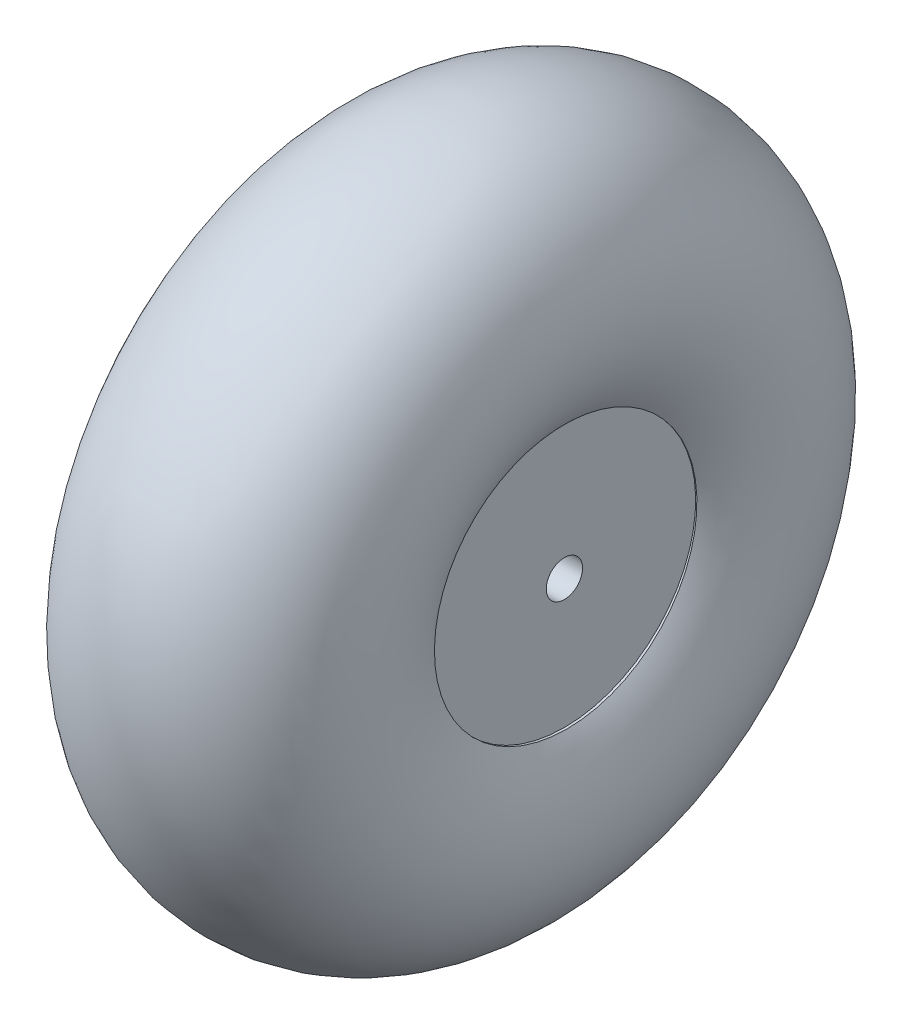
ISO-10303-21;
HEADER;
FILE_DESCRIPTION(('STEP AP214'),'2;1');
FILE_NAME('part.step','',(''),(''),'','','');
FILE_SCHEMA(('AUTOMOTIVE_DESIGN { 1 0 10303 214 1 1 1 1 }'));
ENDSEC;
DATA;
#1=APPLICATION_CONTEXT('core data for automotive mechanical design processes');
#2=APPLICATION_PROTOCOL_DEFINITION('international standard','automotive_design',2000,#1);
#3=PRODUCT_CONTEXT('',#1,'mechanical');
#4=PRODUCT('Part','Part','',(#3));
#5=PRODUCT_RELATED_PRODUCT_CATEGORY('part','',(#4));
#6=PRODUCT_DEFINITION_FORMATION('','',#4);
#7=PRODUCT_DEFINITION_CONTEXT('part definition',#1,'design');
#8=PRODUCT_DEFINITION('design','',#6,#7);
#9=PRODUCT_DEFINITION_SHAPE('','',#8);
#10=(LENGTH_UNIT() NAMED_UNIT(*) SI_UNIT(.MILLI.,.METRE.));
#11=(NAMED_UNIT(*) PLANE_ANGLE_UNIT() SI_UNIT($,.RADIAN.));
#12=(NAMED_UNIT(*) SI_UNIT($,.STERADIAN.) SOLID_ANGLE_UNIT());
#13=UNCERTAINTY_MEASURE_WITH_UNIT(LENGTH_MEASURE(1.E-05),#10,'distance_accuracy_value','');
#14=(GEOMETRIC_REPRESENTATION_CONTEXT(3) GLOBAL_UNCERTAINTY_ASSIGNED_CONTEXT((#13)) GLOBAL_UNIT_ASSIGNED_CONTEXT((#10,
#11,#12)) REPRESENTATION_CONTEXT('',''));
#15=CARTESIAN_POINT('',(0.,0.,0.));
#16=DIRECTION('',(0.,0.,1.));
#17=DIRECTION('',(1.,0.,0.));
#18=AXIS2_PLACEMENT_3D('',#15,#16,#17);
#19=CARTESIAN_POINT('',(6.46192450941706,0.0628953833462041,0.));
#20=DIRECTION('',(-0.999952635503498,-0.00973276680134316,0.));
#21=DIRECTION('',(0.00973276680134316,-0.999952635503498,0.));
#22=AXIS2_PLACEMENT_3D('',#19,#20,#21);
#23=TOROIDAL_SURFACE('',#22,11.4997627808792,7.62);
#24=CARTESIAN_POINT('',(0.0715324477310187,0.000696241609628558,0.));
#25=DIRECTION('',(-0.999952635503498,-0.00973276680134316,0.));
#26=DIRECTION('',(0.00973276680134316,-0.999952635503498,0.));
#27=AXIS2_PLACEMENT_3D('',#24,#25,#26);
#28=CIRCLE('',#27,7.34965187095071);
#29=CARTESIAN_POINT('',(0.143064895462037,-7.34860751678074,0.));
#30=VERTEX_POINT('',#29);
#31=EDGE_CURVE('E55',#30,#30,#28,.T.);
#32=ORIENTED_EDGE('',*,*,#31,.F.);
#33=EDGE_LOOP('',(#32));
#34=FACE_BOUND('',#33,.T.);
#35=CARTESIAN_POINT('',(12.770329418011,0.124296525444178,0.));
#36=DIRECTION('',(-0.999952635503498,-0.00973276680134316,0.));
#37=DIRECTION('',(0.00973276680134316,-0.999952635503498,0.));
#38=AXIS2_PLACEMENT_3D('',#35,#36,#37);
#39=CIRCLE('',#38,7.22604573257365);
#40=CARTESIAN_POINT('',(12.840658836022,-7.10140694911165,0.));
#41=VERTEX_POINT('',#40);
#42=EDGE_CURVE('E11',#41,#41,#39,.T.);
#43=ORIENTED_EDGE('',*,*,#42,.T.);
#44=EDGE_LOOP('',(#43));
#45=FACE_BOUND('',#44,.T.);
#46=ADVANCED_FACE('F49',(#34,#45),#23,.T.);
#47=CARTESIAN_POINT('',(0.0715324477310187,0.000696241609628558,0.));
#48=DIRECTION('',(-0.999952635503498,-0.00973276680134316,0.));
#49=DIRECTION('',(0.00973276680134316,-0.999952635503498,0.));
#50=AXIS2_PLACEMENT_3D('',#47,#48,#49);
#51=CONICAL_SURFACE('',#50,7.34965187095071,0.00973292046678752);
#52=ORIENTED_EDGE('',*,*,#42,.F.);
#53=EDGE_LOOP('',(#52));
#54=FACE_BOUND('',#53,.T.);
#55=ORIENTED_EDGE('',*,*,#31,.T.);
#56=EDGE_LOOP('',(#55));
#57=FACE_BOUND('',#56,.T.);
#58=ADVANCED_FACE('F61',(#54,#57),#51,.F.);
#59=CLOSED_SHELL('',(#46,#58));
#60=MANIFOLD_SOLID_BREP('B2',#59);
#61=CARTESIAN_POINT('',(0.,1.,0.));
#62=DIRECTION('',(1.,0.,0.));
#63=DIRECTION('',(0.,0.,-1.));
#64=AXIS2_PLACEMENT_3D('',#61,#62,#63);
#65=PLANE('',#64);
#66=CARTESIAN_POINT('',(0.,0.,0.));
#67=DIRECTION('',(-1.,0.,0.));
#68=DIRECTION('',(0.,0.,1.));
#69=AXIS2_PLACEMENT_3D('',#66,#67,#68);
#70=CIRCLE('',#69,1.);
#71=CARTESIAN_POINT('',(0.,0.,1.));
#72=VERTEX_POINT('',#71);
#73=EDGE_CURVE('E101',#72,#72,#70,.T.);
#74=ORIENTED_EDGE('',*,*,#73,.F.);
#75=EDGE_LOOP('',(#74));
#76=FACE_BOUND('',#75,.T.);
#77=CARTESIAN_POINT('',(0.,0.,0.));
#78=DIRECTION('',(-1.,0.,0.));
#79=DIRECTION('',(0.,0.,1.));
#80=AXIS2_PLACEMENT_3D('',#77,#78,#79);
#81=CIRCLE('',#80,7.35);
#82=CARTESIAN_POINT('',(0.,0.,7.35));
#83=VERTEX_POINT('',#82);
#84=EDGE_CURVE('E48',#83,#83,#81,.T.);
#85=ORIENTED_EDGE('',*,*,#84,.T.);
#86=EDGE_LOOP('',(#85));
#87=FACE_BOUND('',#86,.T.);
#88=ADVANCED_FACE('F87',(#76,#87),#65,.F.);
#89=CARTESIAN_POINT('',(0.,0.,0.));
#90=DIRECTION('',(-1.,0.,0.));
#91=DIRECTION('',(0.,0.,1.));
#92=AXIS2_PLACEMENT_3D('',#89,#90,#91);
#93=CYLINDRICAL_SURFACE('',#92,7.35);
#94=ORIENTED_EDGE('',*,*,#84,.F.);
#95=EDGE_LOOP('',(#94));
#96=FACE_BOUND('',#95,.T.);
#97=CARTESIAN_POINT('',(12.7,0.,0.));
#98=DIRECTION('',(-1.,0.,0.));
#99=DIRECTION('',(0.,0.,1.));
#100=AXIS2_PLACEMENT_3D('',#97,#98,#99);
#101=CIRCLE('',#100,7.35);
#102=CARTESIAN_POINT('',(12.7,0.,7.35));
#103=VERTEX_POINT('',#102);
#104=EDGE_CURVE('E93',#103,#103,#101,.T.);
#105=ORIENTED_EDGE('',*,*,#104,.T.);
#106=EDGE_LOOP('',(#105));
#107=FACE_BOUND('',#106,.T.);
#108=ADVANCED_FACE('F110',(#96,#107),#93,.T.);
#109=CARTESIAN_POINT('',(12.7,1.,0.));
#110=DIRECTION('',(-1.,0.,0.));
#111=DIRECTION('',(0.,0.,1.));
#112=AXIS2_PLACEMENT_3D('',#109,#110,#111);
#113=PLANE('',#112);
#114=ORIENTED_EDGE('',*,*,#104,.F.);
#115=EDGE_LOOP('',(#114));
#116=FACE_BOUND('',#115,.T.);
#117=CARTESIAN_POINT('',(12.7,0.,0.));
#118=DIRECTION('',(-1.,0.,0.));
#119=DIRECTION('',(0.,0.,1.));
#120=AXIS2_PLACEMENT_3D('',#117,#118,#119);
#121=CIRCLE('',#120,1.);
#122=CARTESIAN_POINT('',(12.7,0.,1.));
#123=VERTEX_POINT('',#122);
#124=EDGE_CURVE('E97',#123,#123,#121,.T.);
#125=ORIENTED_EDGE('',*,*,#124,.T.);
#126=EDGE_LOOP('',(#125));
#127=FACE_BOUND('',#126,.T.);
#128=ADVANCED_FACE('F114',(#116,#127),#113,.F.);
#129=CARTESIAN_POINT('',(0.,0.,0.));
#130=DIRECTION('',(-1.,0.,0.));
#131=DIRECTION('',(0.,0.,1.));
#132=AXIS2_PLACEMENT_3D('',#129,#130,#131);
#133=CYLINDRICAL_SURFACE('',#132,1.);
#134=ORIENTED_EDGE('',*,*,#124,.F.);
#135=EDGE_LOOP('',(#134));
#136=FACE_BOUND('',#135,.T.);
#137=ORIENTED_EDGE('',*,*,#73,.T.);
#138=EDGE_LOOP('',(#137));
#139=FACE_BOUND('',#138,.T.);
#140=ADVANCED_FACE('F107',(#136,#139),#133,.F.);
#141=CLOSED_SHELL('',(#88,#108,#128,#140));
#142=MANIFOLD_SOLID_BREP('B6',#141);
#143=ADVANCED_BREP_SHAPE_REPRESENTATION('',(#18,#60,#142),#14);
#144=SHAPE_DEFINITION_REPRESENTATION(#9,#143);
ENDSEC;
END-ISO-10303-21;
